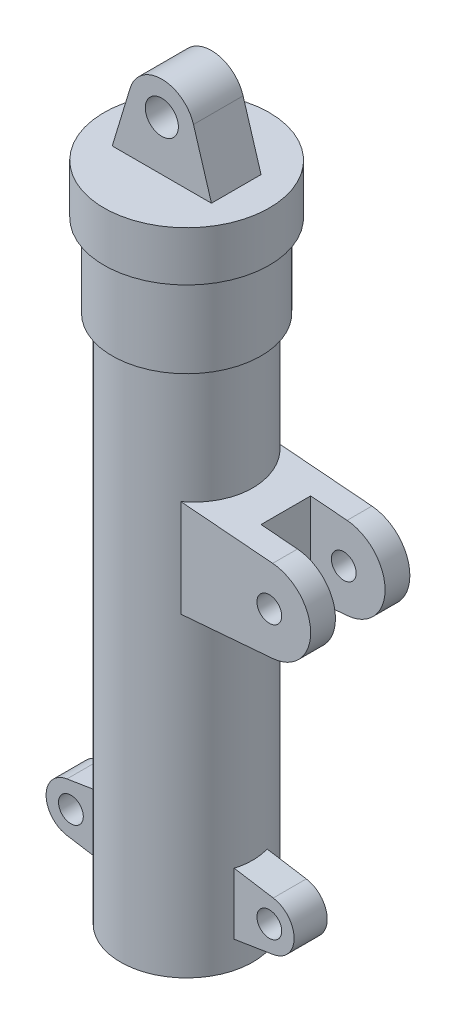
ISO-10303-21;
HEADER;
FILE_DESCRIPTION(('STEP AP214'),'2;1');
FILE_NAME('part.step','',(''),(''),'','','');
FILE_SCHEMA(('AUTOMOTIVE_DESIGN { 1 0 10303 214 1 1 1 1 }'));
ENDSEC;
DATA;
#1=APPLICATION_CONTEXT('core data for automotive mechanical design processes');
#2=APPLICATION_PROTOCOL_DEFINITION('international standard','automotive_design',2000,#1);
#3=PRODUCT_CONTEXT('',#1,'mechanical');
#4=PRODUCT('Part','Part','',(#3));
#5=PRODUCT_RELATED_PRODUCT_CATEGORY('part','',(#4));
#6=PRODUCT_DEFINITION_FORMATION('','',#4);
#7=PRODUCT_DEFINITION_CONTEXT('part definition',#1,'design');
#8=PRODUCT_DEFINITION('design','',#6,#7);
#9=PRODUCT_DEFINITION_SHAPE('','',#8);
#10=(LENGTH_UNIT() NAMED_UNIT(*) SI_UNIT(.MILLI.,.METRE.));
#11=(NAMED_UNIT(*) PLANE_ANGLE_UNIT() SI_UNIT($,.RADIAN.));
#12=(NAMED_UNIT(*) SI_UNIT($,.STERADIAN.) SOLID_ANGLE_UNIT());
#13=UNCERTAINTY_MEASURE_WITH_UNIT(LENGTH_MEASURE(1.E-05),#10,'distance_accuracy_value','');
#14=(GEOMETRIC_REPRESENTATION_CONTEXT(3) GLOBAL_UNCERTAINTY_ASSIGNED_CONTEXT((#13)) GLOBAL_UNIT_ASSIGNED_CONTEXT((#10,
#11,#12)) REPRESENTATION_CONTEXT('',''));
#15=CARTESIAN_POINT('',(0.,0.,0.));
#16=DIRECTION('',(0.,0.,1.));
#17=DIRECTION('',(1.,0.,0.));
#18=AXIS2_PLACEMENT_3D('',#15,#16,#17);
#19=CARTESIAN_POINT('',(20.,250.,30.));
#20=DIRECTION('',(-0.0816633199329582,-0.996659973199249,0.));
#21=DIRECTION('',(0.996659973199249,-0.0816633199329582,0.));
#22=AXIS2_PLACEMENT_3D('',#19,#20,#21);
#23=PLANE('',#22);
#24=DIRECTION('',(-0.996659973199249,0.0816633199329582,0.));
#25=VECTOR('',#24,1.);
#26=CARTESIAN_POINT('',(20.,250.,-15.));
#27=LINE('',#26,#25);
#28=CARTESIAN_POINT('',(82.0415829983239,244.916499329981,-15.));
#29=VERTEX_POINT('',#28);
#30=CARTESIAN_POINT('',(60.,246.722520332754,-15.));
#31=VERTEX_POINT('',#30);
#32=EDGE_CURVE('E185',#29,#31,#27,.T.);
#33=ORIENTED_EDGE('',*,*,#32,.F.);
#34=DIRECTION('',(0.,0.,-1.));
#35=VECTOR('',#34,1.);
#36=CARTESIAN_POINT('',(82.0415829983239,244.916499329981,30.));
#37=LINE('',#36,#35);
#38=CARTESIAN_POINT('',(82.0415829983239,244.916499329981,-30.));
#39=VERTEX_POINT('',#38);
#40=EDGE_CURVE('E220',#29,#39,#37,.T.);
#41=ORIENTED_EDGE('',*,*,#40,.T.);
#42=DIRECTION('',(-0.996659973199249,0.0816633199329583,0.));
#43=VECTOR('',#42,1.);
#44=CARTESIAN_POINT('',(20.,250.,-30.));
#45=LINE('',#44,#43);
#46=CARTESIAN_POINT('',(26.4575131106459,249.470890801972,-30.));
#47=VERTEX_POINT('',#46);
#48=EDGE_CURVE('E210',#39,#47,#45,.T.);
#49=ORIENTED_EDGE('',*,*,#48,.T.);
#50=CARTESIAN_POINT('',(0.,251.638739833623,0.));
#51=DIRECTION('',(-0.0816633199329582,-0.996659973199249,0.));
#52=DIRECTION('',(0.996659973199249,-0.0816633199329582,0.));
#53=AXIS2_PLACEMENT_3D('',#50,#51,#52);
#54=ELLIPSE('',#53,40.13404879861,40.);
#55=CARTESIAN_POINT('',(26.4575131106459,249.470890801972,30.));
#56=VERTEX_POINT('',#55);
#57=EDGE_CURVE('E236',#56,#47,#54,.F.);
#58=ORIENTED_EDGE('',*,*,#57,.F.);
#59=DIRECTION('',(-0.996659973199249,0.0816633199329583,0.));
#60=VECTOR('',#59,1.);
#61=CARTESIAN_POINT('',(20.,250.,30.));
#62=LINE('',#61,#60);
#63=CARTESIAN_POINT('',(82.0415829983239,244.916499329981,30.));
#64=VERTEX_POINT('',#63);
#65=EDGE_CURVE('E213',#64,#56,#62,.T.);
#66=ORIENTED_EDGE('',*,*,#65,.F.);
#67=CARTESIAN_POINT('',(82.0415829983239,244.916499329981,15.));
#68=VERTEX_POINT('',#67);
#69=EDGE_CURVE('E194',#64,#68,#37,.T.);
#70=ORIENTED_EDGE('',*,*,#69,.T.);
#71=DIRECTION('',(-0.996659973199249,0.0816633199329582,0.));
#72=VECTOR('',#71,1.);
#73=CARTESIAN_POINT('',(20.,250.,15.));
#74=LINE('',#73,#72);
#75=CARTESIAN_POINT('',(60.,246.722520332754,15.));
#76=VERTEX_POINT('',#75);
#77=EDGE_CURVE('E53',#68,#76,#74,.T.);
#78=ORIENTED_EDGE('',*,*,#77,.T.);
#79=DIRECTION('',(0.,0.,-1.));
#80=VECTOR('',#79,1.);
#81=CARTESIAN_POINT('',(60.,246.722520332754,30.));
#82=LINE('',#81,#80);
#83=EDGE_CURVE('E177',#76,#31,#82,.T.);
#84=ORIENTED_EDGE('',*,*,#83,.T.);
#85=EDGE_LOOP('',(#33,#41,#49,#58,#66,#70,#78,#84));
#86=FACE_BOUND('',#85,.T.);
#87=ADVANCED_FACE('F38',(#86),#23,.F.);
#88=CARTESIAN_POINT('',(20.,190.,30.));
#89=DIRECTION('',(-0.0816633199329573,0.996659973199249,0.));
#90=DIRECTION('',(-0.996659973199249,-0.0816633199329573,0.));
#91=AXIS2_PLACEMENT_3D('',#88,#89,#90);
#92=PLANE('',#91);
#93=DIRECTION('',(0.996659973199249,0.0816633199329573,0.));
#94=VECTOR('',#93,1.);
#95=CARTESIAN_POINT('',(20.,190.,-15.));
#96=LINE('',#95,#94);
#97=CARTESIAN_POINT('',(60.,193.277479667246,-15.));
#98=VERTEX_POINT('',#97);
#99=CARTESIAN_POINT('',(82.041582998324,195.083500670019,-15.));
#100=VERTEX_POINT('',#99);
#101=EDGE_CURVE('E204',#98,#100,#96,.T.);
#102=ORIENTED_EDGE('',*,*,#101,.F.);
#103=DIRECTION('',(0.,0.,1.));
#104=VECTOR('',#103,1.);
#105=CARTESIAN_POINT('',(60.,193.277479667246,30.));
#106=LINE('',#105,#104);
#107=CARTESIAN_POINT('',(60.,193.277479667246,15.));
#108=VERTEX_POINT('',#107);
#109=EDGE_CURVE('E11',#98,#108,#106,.T.);
#110=ORIENTED_EDGE('',*,*,#109,.T.);
#111=DIRECTION('',(0.996659973199249,0.0816633199329573,0.));
#112=VECTOR('',#111,1.);
#113=CARTESIAN_POINT('',(20.,190.,15.));
#114=LINE('',#113,#112);
#115=CARTESIAN_POINT('',(82.041582998324,195.083500670019,15.));
#116=VERTEX_POINT('',#115);
#117=EDGE_CURVE('E189',#108,#116,#114,.T.);
#118=ORIENTED_EDGE('',*,*,#117,.T.);
#119=DIRECTION('',(0.,0.,-1.));
#120=VECTOR('',#119,1.);
#121=CARTESIAN_POINT('',(82.041582998324,195.083500670019,30.));
#122=LINE('',#121,#120);
#123=CARTESIAN_POINT('',(82.041582998324,195.083500670019,30.));
#124=VERTEX_POINT('',#123);
#125=EDGE_CURVE('E230',#124,#116,#122,.T.);
#126=ORIENTED_EDGE('',*,*,#125,.F.);
#127=DIRECTION('',(0.996659973199249,0.0816633199329573,0.));
#128=VECTOR('',#127,1.);
#129=CARTESIAN_POINT('',(20.,190.,30.));
#130=LINE('',#129,#128);
#131=CARTESIAN_POINT('',(26.457513110646,190.529109198028,30.));
#132=VERTEX_POINT('',#131);
#133=EDGE_CURVE('E61',#132,#124,#130,.T.);
#134=ORIENTED_EDGE('',*,*,#133,.F.);
#135=CARTESIAN_POINT('',(0.,188.361260166377,0.));
#136=DIRECTION('',(-0.0816633199329573,0.996659973199249,0.));
#137=DIRECTION('',(-0.996659973199249,-0.0816633199329573,0.));
#138=AXIS2_PLACEMENT_3D('',#135,#136,#137);
#139=ELLIPSE('',#138,40.13404879861,40.);
#140=CARTESIAN_POINT('',(26.457513110646,190.529109198028,-30.));
#141=VERTEX_POINT('',#140);
#142=EDGE_CURVE('E233',#141,#132,#139,.F.);
#143=ORIENTED_EDGE('',*,*,#142,.F.);
#144=DIRECTION('',(0.996659973199249,0.0816633199329573,0.));
#145=VECTOR('',#144,1.);
#146=CARTESIAN_POINT('',(20.,190.,-30.));
#147=LINE('',#146,#145);
#148=CARTESIAN_POINT('',(82.041582998324,195.083500670019,-30.));
#149=VERTEX_POINT('',#148);
#150=EDGE_CURVE('E223',#141,#149,#147,.T.);
#151=ORIENTED_EDGE('',*,*,#150,.T.);
#152=EDGE_CURVE('E229',#100,#149,#122,.T.);
#153=ORIENTED_EDGE('',*,*,#152,.F.);
#154=EDGE_LOOP('',(#102,#110,#118,#126,#134,#143,#151,#153));
#155=FACE_BOUND('',#154,.T.);
#156=ADVANCED_FACE('F389',(#155),#92,.F.);
#157=CARTESIAN_POINT('',(80.,220.,30.));
#158=DIRECTION('',(0.,0.,-1.));
#159=DIRECTION('',(-1.,0.,0.));
#160=AXIS2_PLACEMENT_3D('',#157,#158,#159);
#161=CYLINDRICAL_SURFACE('',#160,25.);
#162=CARTESIAN_POINT('',(80.,220.,-15.));
#163=DIRECTION('',(0.,0.,1.));
#164=DIRECTION('',(1.,0.,0.));
#165=AXIS2_PLACEMENT_3D('',#162,#163,#164);
#166=CIRCLE('',#165,25.);
#167=EDGE_CURVE('E198',#100,#29,#166,.T.);
#168=ORIENTED_EDGE('',*,*,#167,.F.);
#169=ORIENTED_EDGE('',*,*,#152,.T.);
#170=CARTESIAN_POINT('',(80.,220.,-30.));
#171=DIRECTION('',(0.,0.,1.));
#172=DIRECTION('',(1.,0.,0.));
#173=AXIS2_PLACEMENT_3D('',#170,#171,#172);
#174=CIRCLE('',#173,25.);
#175=EDGE_CURVE('E216',#149,#39,#174,.T.);
#176=ORIENTED_EDGE('',*,*,#175,.T.);
#177=ORIENTED_EDGE('',*,*,#40,.F.);
#178=EDGE_LOOP('',(#168,#169,#176,#177));
#179=FACE_BOUND('',#178,.T.);
#180=ADVANCED_FACE('F393',(#179),#161,.T.);
#181=CARTESIAN_POINT('',(80.,220.,30.));
#182=DIRECTION('',(0.,0.,-1.));
#183=DIRECTION('',(-1.,0.,0.));
#184=AXIS2_PLACEMENT_3D('',#181,#182,#183);
#185=CYLINDRICAL_SURFACE('',#184,7.50000000000001);
#186=CARTESIAN_POINT('',(80.,220.,-30.));
#187=DIRECTION('',(0.,0.,1.));
#188=DIRECTION('',(1.,0.,0.));
#189=AXIS2_PLACEMENT_3D('',#186,#187,#188);
#190=CIRCLE('',#189,7.50000000000001);
#191=CARTESIAN_POINT('',(87.5,220.,-30.));
#192=VERTEX_POINT('',#191);
#193=EDGE_CURVE('E184',#192,#192,#190,.T.);
#194=ORIENTED_EDGE('',*,*,#193,.F.);
#195=EDGE_LOOP('',(#194));
#196=FACE_BOUND('',#195,.T.);
#197=CARTESIAN_POINT('',(80.,220.,-15.));
#198=DIRECTION('',(0.,0.,1.));
#199=DIRECTION('',(1.,0.,0.));
#200=AXIS2_PLACEMENT_3D('',#197,#198,#199);
#201=CIRCLE('',#200,7.50000000000001);
#202=CARTESIAN_POINT('',(87.5,220.,-15.));
#203=VERTEX_POINT('',#202);
#204=EDGE_CURVE('E195',#203,#203,#201,.T.);
#205=ORIENTED_EDGE('',*,*,#204,.T.);
#206=EDGE_LOOP('',(#205));
#207=FACE_BOUND('',#206,.T.);
#208=ADVANCED_FACE('F416',(#196,#207),#185,.F.);
#209=CARTESIAN_POINT('',(0.,-64.3364928909953,0.));
#210=DIRECTION('',(0.,-1.,0.));
#211=DIRECTION('',(0.,0.,-1.));
#212=AXIS2_PLACEMENT_3D('',#209,#210,#211);
#213=CYLINDRICAL_SURFACE('',#212,40.);
#214=DIRECTION('',(0.,-1.,0.));
#215=VECTOR('',#214,1.);
#216=CARTESIAN_POINT('',(-38.7298334620742,-64.3364928909953,10.));
#217=LINE('',#216,#215);
#218=CARTESIAN_POINT('',(-38.7298334620742,16.3992579379608,10.));
#219=VERTEX_POINT('',#218);
#220=CARTESIAN_POINT('',(-38.7298334620742,53.6007420620392,10.));
#221=VERTEX_POINT('',#220);
#222=EDGE_CURVE('E268',#219,#221,#217,.F.);
#223=ORIENTED_EDGE('',*,*,#222,.F.);
#224=CARTESIAN_POINT('',(0.,10.1914617476733,0.));
#225=DIRECTION('',(-0.158264501869385,-0.987396752804077,0.));
#226=DIRECTION('',(0.987396752804077,-0.158264501869385,0.));
#227=AXIS2_PLACEMENT_3D('',#224,#225,#226);
#228=ELLIPSE('',#227,40.5105646604623,40.);
#229=CARTESIAN_POINT('',(-38.7298334620742,16.3992579379608,-10.));
#230=VERTEX_POINT('',#229);
#231=EDGE_CURVE('E273',#230,#219,#228,.F.);
#232=ORIENTED_EDGE('',*,*,#231,.F.);
#233=DIRECTION('',(0.,-1.,0.));
#234=VECTOR('',#233,1.);
#235=CARTESIAN_POINT('',(-38.7298334620742,-64.3364928909953,-10.));
#236=LINE('',#235,#234);
#237=CARTESIAN_POINT('',(-38.7298334620742,53.6007420620392,-10.));
#238=VERTEX_POINT('',#237);
#239=EDGE_CURVE('E265',#230,#238,#236,.F.);
#240=ORIENTED_EDGE('',*,*,#239,.T.);
#241=CARTESIAN_POINT('',(0.,59.8085382523267,0.));
#242=DIRECTION('',(-0.158264501869385,0.987396752804077,0.));
#243=DIRECTION('',(-0.987396752804077,-0.158264501869385,0.));
#244=AXIS2_PLACEMENT_3D('',#241,#242,#243);
#245=ELLIPSE('',#244,40.5105646604623,40.);
#246=EDGE_CURVE('E270',#221,#238,#245,.F.);
#247=ORIENTED_EDGE('',*,*,#246,.F.);
#248=EDGE_LOOP('',(#223,#232,#240,#247));
#249=FACE_BOUND('',#248,.T.);
#250=CARTESIAN_POINT('',(0.,320.,0.));
#251=DIRECTION('',(0.,-1.,0.));
#252=DIRECTION('',(0.,0.,-1.));
#253=AXIS2_PLACEMENT_3D('',#250,#251,#252);
#254=CIRCLE('',#253,40.);
#255=CARTESIAN_POINT('',(0.,320.,-40.));
#256=VERTEX_POINT('',#255);
#257=EDGE_CURVE('E360',#256,#256,#254,.T.);
#258=ORIENTED_EDGE('',*,*,#257,.T.);
#259=EDGE_LOOP('',(#258));
#260=FACE_BOUND('',#259,.T.);
#261=CARTESIAN_POINT('',(0.,0.,0.));
#262=DIRECTION('',(0.,-1.,0.));
#263=DIRECTION('',(0.,0.,-1.));
#264=AXIS2_PLACEMENT_3D('',#261,#262,#263);
#265=CIRCLE('',#264,40.);
#266=CARTESIAN_POINT('',(0.,0.,-40.));
#267=VERTEX_POINT('',#266);
#268=EDGE_CURVE('E357',#267,#267,#265,.T.);
#269=ORIENTED_EDGE('',*,*,#268,.F.);
#270=EDGE_LOOP('',(#269));
#271=FACE_BOUND('',#270,.T.);
#272=DIRECTION('',(0.,-1.,0.));
#273=VECTOR('',#272,1.);
#274=CARTESIAN_POINT('',(38.7298334620742,-64.3364928909953,-10.));
#275=LINE('',#274,#273);
#276=CARTESIAN_POINT('',(38.7298334620742,53.6007420620392,-10.));
#277=VERTEX_POINT('',#276);
#278=CARTESIAN_POINT('',(38.7298334620742,16.3992579379608,-10.));
#279=VERTEX_POINT('',#278);
#280=EDGE_CURVE('E306',#277,#279,#275,.T.);
#281=ORIENTED_EDGE('',*,*,#280,.T.);
#282=CARTESIAN_POINT('',(0.,10.1914617476733,0.));
#283=DIRECTION('',(-0.158264501869385,0.987396752804077,0.));
#284=DIRECTION('',(-0.987396752804077,-0.158264501869385,0.));
#285=AXIS2_PLACEMENT_3D('',#282,#283,#284);
#286=ELLIPSE('',#285,40.5105646604623,40.);
#287=CARTESIAN_POINT('',(38.7298334620742,16.3992579379608,10.));
#288=VERTEX_POINT('',#287);
#289=EDGE_CURVE('E303',#279,#288,#286,.F.);
#290=ORIENTED_EDGE('',*,*,#289,.T.);
#291=DIRECTION('',(0.,-1.,0.));
#292=VECTOR('',#291,1.);
#293=CARTESIAN_POINT('',(38.7298334620742,-64.3364928909953,10.));
#294=LINE('',#293,#292);
#295=CARTESIAN_POINT('',(38.7298334620742,53.6007420620392,10.));
#296=VERTEX_POINT('',#295);
#297=EDGE_CURVE('E309',#296,#288,#294,.T.);
#298=ORIENTED_EDGE('',*,*,#297,.F.);
#299=CARTESIAN_POINT('',(0.,59.8085382523267,0.));
#300=DIRECTION('',(-0.158264501869385,-0.987396752804077,0.));
#301=DIRECTION('',(0.987396752804077,-0.158264501869385,0.));
#302=AXIS2_PLACEMENT_3D('',#299,#300,#301);
#303=ELLIPSE('',#302,40.5105646604623,40.);
#304=EDGE_CURVE('E300',#296,#277,#303,.F.);
#305=ORIENTED_EDGE('',*,*,#304,.T.);
#306=EDGE_LOOP('',(#281,#290,#298,#305));
#307=FACE_BOUND('',#306,.T.);
#308=DIRECTION('',(0.,-1.,0.));
#309=VECTOR('',#308,1.);
#310=CARTESIAN_POINT('',(26.4575131106459,-64.3364928909953,30.));
#311=LINE('',#310,#309);
#312=EDGE_CURVE('E46',#56,#132,#311,.T.);
#313=ORIENTED_EDGE('',*,*,#312,.F.);
#314=ORIENTED_EDGE('',*,*,#57,.T.);
#315=DIRECTION('',(0.,-1.,0.));
#316=VECTOR('',#315,1.);
#317=CARTESIAN_POINT('',(26.4575131106459,-64.3364928909953,-30.));
#318=LINE('',#317,#316);
#319=EDGE_CURVE('E375',#47,#141,#318,.T.);
#320=ORIENTED_EDGE('',*,*,#319,.T.);
#321=ORIENTED_EDGE('',*,*,#142,.T.);
#322=EDGE_LOOP('',(#313,#314,#320,#321));
#323=FACE_BOUND('',#322,.T.);
#324=ADVANCED_FACE('F399',(#249,#260,#271,#307,#323),#213,.T.);
#325=CARTESIAN_POINT('',(0.,-64.3364928909953,0.));
#326=DIRECTION('',(0.,-1.,0.));
#327=DIRECTION('',(0.,0.,-1.));
#328=AXIS2_PLACEMENT_3D('',#325,#326,#327);
#329=CYLINDRICAL_SURFACE('',#328,35.);
#330=CARTESIAN_POINT('',(0.,4.99999999999999,0.));
#331=DIRECTION('',(0.,-1.,0.));
#332=DIRECTION('',(0.,0.,-1.));
#333=AXIS2_PLACEMENT_3D('',#330,#331,#332);
#334=CIRCLE('',#333,35.);
#335=CARTESIAN_POINT('',(0.,4.99999999999999,-35.));
#336=VERTEX_POINT('',#335);
#337=EDGE_CURVE('E348',#336,#336,#334,.T.);
#338=ORIENTED_EDGE('',*,*,#337,.T.);
#339=EDGE_LOOP('',(#338));
#340=FACE_BOUND('',#339,.T.);
#341=CARTESIAN_POINT('',(0.,385.,0.));
#342=DIRECTION('',(0.,-1.,0.));
#343=DIRECTION('',(0.,0.,-1.));
#344=AXIS2_PLACEMENT_3D('',#341,#342,#343);
#345=CIRCLE('',#344,35.);
#346=CARTESIAN_POINT('',(0.,385.,-35.));
#347=VERTEX_POINT('',#346);
#348=EDGE_CURVE('E345',#347,#347,#345,.T.);
#349=ORIENTED_EDGE('',*,*,#348,.F.);
#350=EDGE_LOOP('',(#349));
#351=FACE_BOUND('',#350,.T.);
#352=ADVANCED_FACE('F503',(#340,#351),#329,.F.);
#353=CARTESIAN_POINT('',(0.,400.,0.));
#354=DIRECTION('',(0.,1.,0.));
#355=DIRECTION('',(0.,0.,1.));
#356=AXIS2_PLACEMENT_3D('',#353,#354,#355);
#357=PLANE('',#356);
#358=CARTESIAN_POINT('',(0.,400.,0.));
#359=DIRECTION('',(0.,-1.,0.));
#360=DIRECTION('',(0.,0.,-1.));
#361=AXIS2_PLACEMENT_3D('',#358,#359,#360);
#362=CIRCLE('',#361,50.);
#363=CARTESIAN_POINT('',(0.,400.,-50.));
#364=VERTEX_POINT('',#363);
#365=EDGE_CURVE('E372',#364,#364,#362,.T.);
#366=ORIENTED_EDGE('',*,*,#365,.F.);
#367=EDGE_LOOP('',(#366));
#368=FACE_BOUND('',#367,.T.);
#369=DIRECTION('',(0.,0.,-1.));
#370=VECTOR('',#369,1.);
#371=CARTESIAN_POINT('',(-30.,400.,15.));
#372=LINE('',#371,#370);
#373=CARTESIAN_POINT('',(-30.,400.,15.));
#374=VERTEX_POINT('',#373);
#375=CARTESIAN_POINT('',(-30.,400.,-15.));
#376=VERTEX_POINT('',#375);
#377=EDGE_CURVE('E342',#374,#376,#372,.T.);
#378=ORIENTED_EDGE('',*,*,#377,.T.);
#379=DIRECTION('',(1.,0.,0.));
#380=VECTOR('',#379,1.);
#381=CARTESIAN_POINT('',(-30.,400.,-15.));
#382=LINE('',#381,#380);
#383=CARTESIAN_POINT('',(30.,400.,-15.));
#384=VERTEX_POINT('',#383);
#385=EDGE_CURVE('E329',#376,#384,#382,.T.);
#386=ORIENTED_EDGE('',*,*,#385,.T.);
#387=DIRECTION('',(0.,0.,-1.));
#388=VECTOR('',#387,1.);
#389=CARTESIAN_POINT('',(30.,400.,15.));
#390=LINE('',#389,#388);
#391=CARTESIAN_POINT('',(30.,400.,15.));
#392=VERTEX_POINT('',#391);
#393=EDGE_CURVE('E340',#392,#384,#390,.T.);
#394=ORIENTED_EDGE('',*,*,#393,.F.);
#395=DIRECTION('',(1.,0.,0.));
#396=VECTOR('',#395,1.);
#397=CARTESIAN_POINT('',(-30.,400.,15.));
#398=LINE('',#397,#396);
#399=EDGE_CURVE('E320',#374,#392,#398,.T.);
#400=ORIENTED_EDGE('',*,*,#399,.F.);
#401=EDGE_LOOP('',(#378,#386,#394,#400));
#402=FACE_BOUND('',#401,.T.);
#403=ADVANCED_FACE('F40',(#368,#402),#357,.T.);
#404=CARTESIAN_POINT('',(0.,-64.3364928909953,0.));
#405=DIRECTION('',(0.,-1.,0.));
#406=DIRECTION('',(0.,0.,-1.));
#407=AXIS2_PLACEMENT_3D('',#404,#405,#406);
#408=CYLINDRICAL_SURFACE('',#407,50.);
#409=ORIENTED_EDGE('',*,*,#365,.T.);
#410=EDGE_LOOP('',(#409));
#411=FACE_BOUND('',#410,.T.);
#412=CARTESIAN_POINT('',(0.,370.,0.));
#413=DIRECTION('',(0.,-1.,0.));
#414=DIRECTION('',(0.,0.,-1.));
#415=AXIS2_PLACEMENT_3D('',#412,#413,#414);
#416=CIRCLE('',#415,50.);
#417=CARTESIAN_POINT('',(0.,370.,-50.));
#418=VERTEX_POINT('',#417);
#419=EDGE_CURVE('E369',#418,#418,#416,.T.);
#420=ORIENTED_EDGE('',*,*,#419,.F.);
#421=EDGE_LOOP('',(#420));
#422=FACE_BOUND('',#421,.T.);
#423=ADVANCED_FACE('F531',(#411,#422),#408,.T.);
#424=CARTESIAN_POINT('',(50.,370.,0.));
#425=DIRECTION('',(0.,-1.,0.));
#426=DIRECTION('',(0.,0.,-1.));
#427=AXIS2_PLACEMENT_3D('',#424,#425,#426);
#428=PLANE('',#427);
#429=ORIENTED_EDGE('',*,*,#419,.T.);
#430=EDGE_LOOP('',(#429));
#431=FACE_BOUND('',#430,.T.);
#432=CARTESIAN_POINT('',(0.,370.,0.));
#433=DIRECTION('',(0.,-1.,0.));
#434=DIRECTION('',(0.,0.,-1.));
#435=AXIS2_PLACEMENT_3D('',#432,#433,#434);
#436=CIRCLE('',#435,45.);
#437=CARTESIAN_POINT('',(0.,370.,-45.));
#438=VERTEX_POINT('',#437);
#439=EDGE_CURVE('E366',#438,#438,#436,.T.);
#440=ORIENTED_EDGE('',*,*,#439,.F.);
#441=EDGE_LOOP('',(#440));
#442=FACE_BOUND('',#441,.T.);
#443=ADVANCED_FACE('F528',(#431,#442),#428,.T.);
#444=CARTESIAN_POINT('',(0.,-64.3364928909953,0.));
#445=DIRECTION('',(0.,-1.,0.));
#446=DIRECTION('',(0.,0.,-1.));
#447=AXIS2_PLACEMENT_3D('',#444,#445,#446);
#448=CYLINDRICAL_SURFACE('',#447,45.);
#449=ORIENTED_EDGE('',*,*,#439,.T.);
#450=EDGE_LOOP('',(#449));
#451=FACE_BOUND('',#450,.T.);
#452=CARTESIAN_POINT('',(0.,320.,0.));
#453=DIRECTION('',(0.,-1.,0.));
#454=DIRECTION('',(0.,0.,-1.));
#455=AXIS2_PLACEMENT_3D('',#452,#453,#454);
#456=CIRCLE('',#455,45.);
#457=CARTESIAN_POINT('',(0.,320.,-45.));
#458=VERTEX_POINT('',#457);
#459=EDGE_CURVE('E363',#458,#458,#456,.T.);
#460=ORIENTED_EDGE('',*,*,#459,.F.);
#461=EDGE_LOOP('',(#460));
#462=FACE_BOUND('',#461,.T.);
#463=ADVANCED_FACE('F524',(#451,#462),#448,.T.);
#464=CARTESIAN_POINT('',(45.,320.,0.));
#465=DIRECTION('',(0.,-1.,0.));
#466=DIRECTION('',(0.,0.,-1.));
#467=AXIS2_PLACEMENT_3D('',#464,#465,#466);
#468=PLANE('',#467);
#469=ORIENTED_EDGE('',*,*,#459,.T.);
#470=EDGE_LOOP('',(#469));
#471=FACE_BOUND('',#470,.T.);
#472=ORIENTED_EDGE('',*,*,#257,.F.);
#473=EDGE_LOOP('',(#472));
#474=FACE_BOUND('',#473,.T.);
#475=ADVANCED_FACE('F517',(#471,#474),#468,.T.);
#476=CARTESIAN_POINT('',(40.,0.,0.));
#477=DIRECTION('',(0.,-1.,0.));
#478=DIRECTION('',(0.,0.,-1.));
#479=AXIS2_PLACEMENT_3D('',#476,#477,#478);
#480=PLANE('',#479);
#481=ORIENTED_EDGE('',*,*,#268,.T.);
#482=EDGE_LOOP('',(#481));
#483=FACE_BOUND('',#482,.T.);
#484=CARTESIAN_POINT('',(0.,0.,0.));
#485=DIRECTION('',(0.,-1.,0.));
#486=DIRECTION('',(0.,0.,-1.));
#487=AXIS2_PLACEMENT_3D('',#484,#485,#486);
#488=CIRCLE('',#487,22.5);
#489=CARTESIAN_POINT('',(0.,0.,-22.5));
#490=VERTEX_POINT('',#489);
#491=EDGE_CURVE('E354',#490,#490,#488,.T.);
#492=ORIENTED_EDGE('',*,*,#491,.F.);
#493=EDGE_LOOP('',(#492));
#494=FACE_BOUND('',#493,.T.);
#495=ADVANCED_FACE('F513',(#483,#494),#480,.T.);
#496=CARTESIAN_POINT('',(0.,-64.3364928909953,0.));
#497=DIRECTION('',(0.,-1.,0.));
#498=DIRECTION('',(0.,0.,-1.));
#499=AXIS2_PLACEMENT_3D('',#496,#497,#498);
#500=CYLINDRICAL_SURFACE('',#499,22.5);
#501=ORIENTED_EDGE('',*,*,#491,.T.);
#502=EDGE_LOOP('',(#501));
#503=FACE_BOUND('',#502,.T.);
#504=CARTESIAN_POINT('',(0.,5.,0.));
#505=DIRECTION('',(0.,-1.,0.));
#506=DIRECTION('',(0.,0.,-1.));
#507=AXIS2_PLACEMENT_3D('',#504,#505,#506);
#508=CIRCLE('',#507,22.5);
#509=CARTESIAN_POINT('',(0.,5.,-22.5));
#510=VERTEX_POINT('',#509);
#511=EDGE_CURVE('E351',#510,#510,#508,.T.);
#512=ORIENTED_EDGE('',*,*,#511,.F.);
#513=EDGE_LOOP('',(#512));
#514=FACE_BOUND('',#513,.T.);
#515=ADVANCED_FACE('F509',(#503,#514),#500,.F.);
#516=CARTESIAN_POINT('',(22.5,5.,0.));
#517=DIRECTION('',(0.,1.,0.));
#518=DIRECTION('',(0.,0.,1.));
#519=AXIS2_PLACEMENT_3D('',#516,#517,#518);
#520=PLANE('',#519);
#521=ORIENTED_EDGE('',*,*,#511,.T.);
#522=EDGE_LOOP('',(#521));
#523=FACE_BOUND('',#522,.T.);
#524=ORIENTED_EDGE('',*,*,#337,.F.);
#525=EDGE_LOOP('',(#524));
#526=FACE_BOUND('',#525,.T.);
#527=ADVANCED_FACE('F501',(#523,#526),#520,.T.);
#528=CARTESIAN_POINT('',(35.,385.,0.));
#529=DIRECTION('',(0.,-1.,0.));
#530=DIRECTION('',(0.,0.,-1.));
#531=AXIS2_PLACEMENT_3D('',#528,#529,#530);
#532=PLANE('',#531);
#533=ORIENTED_EDGE('',*,*,#348,.T.);
#534=EDGE_LOOP('',(#533));
#535=FACE_BOUND('',#534,.T.);
#536=ADVANCED_FACE('F483',(#535),#532,.T.);
#537=CARTESIAN_POINT('',(0.,430.,15.));
#538=DIRECTION('',(0.,0.,1.));
#539=DIRECTION('',(1.,0.,0.));
#540=AXIS2_PLACEMENT_3D('',#537,#538,#539);
#541=PLANE('',#540);
#542=DIRECTION('',(-0.29027623112899,-0.956942897795657,0.));
#543=VECTOR('',#542,1.);
#544=CARTESIAN_POINT('',(-30.,400.,15.));
#545=LINE('',#544,#543);
#546=CARTESIAN_POINT('',(-19.1388579559131,435.80552462258,15.));
#547=VERTEX_POINT('',#546);
#548=EDGE_CURVE('E318',#547,#374,#545,.T.);
#549=ORIENTED_EDGE('',*,*,#548,.T.);
#550=ORIENTED_EDGE('',*,*,#399,.T.);
#551=DIRECTION('',(-0.29027623112899,0.956942897795657,0.));
#552=VECTOR('',#551,1.);
#553=CARTESIAN_POINT('',(30.,400.,15.));
#554=LINE('',#553,#552);
#555=CARTESIAN_POINT('',(19.1388579559131,435.80552462258,15.));
#556=VERTEX_POINT('',#555);
#557=EDGE_CURVE('E323',#392,#556,#554,.T.);
#558=ORIENTED_EDGE('',*,*,#557,.T.);
#559=CARTESIAN_POINT('',(0.,430.,15.));
#560=DIRECTION('',(0.,0.,1.));
#561=DIRECTION('',(1.,0.,0.));
#562=AXIS2_PLACEMENT_3D('',#559,#560,#561);
#563=CIRCLE('',#562,20.);
#564=EDGE_CURVE('E325',#556,#547,#563,.T.);
#565=ORIENTED_EDGE('',*,*,#564,.T.);
#566=EDGE_LOOP('',(#549,#550,#558,#565));
#567=FACE_BOUND('',#566,.T.);
#568=CARTESIAN_POINT('',(0.,430.,15.));
#569=DIRECTION('',(0.,0.,1.));
#570=DIRECTION('',(1.,0.,0.));
#571=AXIS2_PLACEMENT_3D('',#568,#569,#570);
#572=CIRCLE('',#571,10.);
#573=CARTESIAN_POINT('',(10.,430.,15.));
#574=VERTEX_POINT('',#573);
#575=EDGE_CURVE('E312',#574,#574,#572,.T.);
#576=ORIENTED_EDGE('',*,*,#575,.F.);
#577=EDGE_LOOP('',(#576));
#578=FACE_BOUND('',#577,.T.);
#579=ADVANCED_FACE('F479',(#567,#578),#541,.T.);
#580=CARTESIAN_POINT('',(0.,430.,-15.));
#581=DIRECTION('',(0.,0.,1.));
#582=DIRECTION('',(1.,0.,0.));
#583=AXIS2_PLACEMENT_3D('',#580,#581,#582);
#584=PLANE('',#583);
#585=DIRECTION('',(-0.29027623112899,-0.956942897795657,0.));
#586=VECTOR('',#585,1.);
#587=CARTESIAN_POINT('',(-30.,400.,-15.));
#588=LINE('',#587,#586);
#589=CARTESIAN_POINT('',(-19.1388579559131,435.80552462258,-15.));
#590=VERTEX_POINT('',#589);
#591=EDGE_CURVE('E315',#590,#376,#588,.T.);
#592=ORIENTED_EDGE('',*,*,#591,.F.);
#593=CARTESIAN_POINT('',(0.,430.,-15.));
#594=DIRECTION('',(0.,0.,1.));
#595=DIRECTION('',(1.,0.,0.));
#596=AXIS2_PLACEMENT_3D('',#593,#594,#595);
#597=CIRCLE('',#596,20.);
#598=CARTESIAN_POINT('',(19.1388579559131,435.80552462258,-15.));
#599=VERTEX_POINT('',#598);
#600=EDGE_CURVE('E321',#599,#590,#597,.T.);
#601=ORIENTED_EDGE('',*,*,#600,.F.);
#602=DIRECTION('',(-0.29027623112899,0.956942897795657,0.));
#603=VECTOR('',#602,1.);
#604=CARTESIAN_POINT('',(30.,400.,-15.));
#605=LINE('',#604,#603);
#606=EDGE_CURVE('E332',#384,#599,#605,.T.);
#607=ORIENTED_EDGE('',*,*,#606,.F.);
#608=ORIENTED_EDGE('',*,*,#385,.F.);
#609=EDGE_LOOP('',(#592,#601,#607,#608));
#610=FACE_BOUND('',#609,.T.);
#611=CARTESIAN_POINT('',(0.,430.,-15.));
#612=DIRECTION('',(0.,0.,1.));
#613=DIRECTION('',(1.,0.,0.));
#614=AXIS2_PLACEMENT_3D('',#611,#612,#613);
#615=CIRCLE('',#614,10.);
#616=CARTESIAN_POINT('',(10.,430.,-15.));
#617=VERTEX_POINT('',#616);
#618=EDGE_CURVE('E311',#617,#617,#615,.T.);
#619=ORIENTED_EDGE('',*,*,#618,.T.);
#620=EDGE_LOOP('',(#619));
#621=FACE_BOUND('',#620,.T.);
#622=ADVANCED_FACE('F482',(#610,#621),#584,.F.);
#623=CARTESIAN_POINT('',(-30.,400.,15.));
#624=DIRECTION('',(0.956942897795657,-0.29027623112899,0.));
#625=DIRECTION('',(0.29027623112899,0.956942897795657,0.));
#626=AXIS2_PLACEMENT_3D('',#623,#624,#625);
#627=PLANE('',#626);
#628=ORIENTED_EDGE('',*,*,#591,.T.);
#629=ORIENTED_EDGE('',*,*,#377,.F.);
#630=ORIENTED_EDGE('',*,*,#548,.F.);
#631=DIRECTION('',(0.,0.,-1.));
#632=VECTOR('',#631,1.);
#633=CARTESIAN_POINT('',(-19.1388579559131,435.80552462258,15.));
#634=LINE('',#633,#632);
#635=EDGE_CURVE('E327',#547,#590,#634,.T.);
#636=ORIENTED_EDGE('',*,*,#635,.T.);
#637=EDGE_LOOP('',(#628,#629,#630,#636));
#638=FACE_BOUND('',#637,.T.);
#639=ADVANCED_FACE('F487',(#638),#627,.F.);
#640=CARTESIAN_POINT('',(30.,400.,15.));
#641=DIRECTION('',(-0.956942897795657,-0.29027623112899,0.));
#642=DIRECTION('',(0.29027623112899,-0.956942897795657,0.));
#643=AXIS2_PLACEMENT_3D('',#640,#641,#642);
#644=PLANE('',#643);
#645=ORIENTED_EDGE('',*,*,#606,.T.);
#646=DIRECTION('',(0.,0.,-1.));
#647=VECTOR('',#646,1.);
#648=CARTESIAN_POINT('',(19.1388579559131,435.80552462258,15.));
#649=LINE('',#648,#647);
#650=EDGE_CURVE('E337',#556,#599,#649,.T.);
#651=ORIENTED_EDGE('',*,*,#650,.F.);
#652=ORIENTED_EDGE('',*,*,#557,.F.);
#653=ORIENTED_EDGE('',*,*,#393,.T.);
#654=EDGE_LOOP('',(#645,#651,#652,#653));
#655=FACE_BOUND('',#654,.T.);
#656=ADVANCED_FACE('F491',(#655),#644,.F.);
#657=CARTESIAN_POINT('',(0.,430.,15.));
#658=DIRECTION('',(0.,0.,-1.));
#659=DIRECTION('',(-1.,0.,0.));
#660=AXIS2_PLACEMENT_3D('',#657,#658,#659);
#661=CYLINDRICAL_SURFACE('',#660,20.);
#662=ORIENTED_EDGE('',*,*,#600,.T.);
#663=ORIENTED_EDGE('',*,*,#635,.F.);
#664=ORIENTED_EDGE('',*,*,#564,.F.);
#665=ORIENTED_EDGE('',*,*,#650,.T.);
#666=EDGE_LOOP('',(#662,#663,#664,#665));
#667=FACE_BOUND('',#666,.T.);
#668=ADVANCED_FACE('F477',(#667),#661,.T.);
#669=CARTESIAN_POINT('',(0.,430.,15.));
#670=DIRECTION('',(0.,0.,-1.));
#671=DIRECTION('',(-1.,0.,0.));
#672=AXIS2_PLACEMENT_3D('',#669,#670,#671);
#673=CYLINDRICAL_SURFACE('',#672,10.);
#674=ORIENTED_EDGE('',*,*,#575,.T.);
#675=EDGE_LOOP('',(#674));
#676=FACE_BOUND('',#675,.T.);
#677=ORIENTED_EDGE('',*,*,#618,.F.);
#678=EDGE_LOOP('',(#677));
#679=FACE_BOUND('',#678,.T.);
#680=ADVANCED_FACE('F459',(#676,#679),#673,.F.);
#681=CARTESIAN_POINT('',(60.0000000000001,35.,10.));
#682=DIRECTION('',(0.,0.,1.));
#683=DIRECTION('',(1.,0.,0.));
#684=AXIS2_PLACEMENT_3D('',#681,#682,#683);
#685=PLANE('',#684);
#686=CARTESIAN_POINT('',(60.0000000000001,35.,10.));
#687=DIRECTION('',(0.,0.,1.));
#688=DIRECTION('',(1.,0.,0.));
#689=AXIS2_PLACEMENT_3D('',#686,#687,#688);
#690=CIRCLE('',#689,7.50000000000001);
#691=CARTESIAN_POINT('',(67.5000000000001,35.,10.));
#692=VERTEX_POINT('',#691);
#693=EDGE_CURVE('E276',#692,#692,#690,.T.);
#694=ORIENTED_EDGE('',*,*,#693,.F.);
#695=EDGE_LOOP('',(#694));
#696=FACE_BOUND('',#695,.T.);
#697=DIRECTION('',(-0.987396752804077,0.158264501869385,0.));
#698=VECTOR('',#697,1.);
#699=CARTESIAN_POINT('',(30.0000000000001,55.,10.));
#700=LINE('',#699,#698);
#701=CARTESIAN_POINT('',(62.3739675280408,49.8109512920612,10.));
#702=VERTEX_POINT('',#701);
#703=EDGE_CURVE('E287',#702,#296,#700,.T.);
#704=ORIENTED_EDGE('',*,*,#703,.T.);
#705=ORIENTED_EDGE('',*,*,#297,.T.);
#706=DIRECTION('',(0.987396752804077,0.158264501869385,0.));
#707=VECTOR('',#706,1.);
#708=CARTESIAN_POINT('',(30.0000000000001,15.,10.));
#709=LINE('',#708,#707);
#710=CARTESIAN_POINT('',(62.3739675280408,20.1890487079389,10.));
#711=VERTEX_POINT('',#710);
#712=EDGE_CURVE('E282',#288,#711,#709,.T.);
#713=ORIENTED_EDGE('',*,*,#712,.T.);
#714=CARTESIAN_POINT('',(60.0000000000001,35.,10.));
#715=DIRECTION('',(0.,0.,1.));
#716=DIRECTION('',(1.,0.,0.));
#717=AXIS2_PLACEMENT_3D('',#714,#715,#716);
#718=CIRCLE('',#717,15.);
#719=EDGE_CURVE('E284',#711,#702,#718,.T.);
#720=ORIENTED_EDGE('',*,*,#719,.T.);
#721=EDGE_LOOP('',(#704,#705,#713,#720));
#722=FACE_BOUND('',#721,.T.);
#723=ADVANCED_FACE('F455',(#696,#722),#685,.T.);
#724=CARTESIAN_POINT('',(60.0000000000001,35.,-10.));
#725=DIRECTION('',(0.,0.,1.));
#726=DIRECTION('',(1.,0.,0.));
#727=AXIS2_PLACEMENT_3D('',#724,#725,#726);
#728=PLANE('',#727);
#729=ORIENTED_EDGE('',*,*,#280,.F.);
#730=DIRECTION('',(-0.987396752804077,0.158264501869385,0.));
#731=VECTOR('',#730,1.);
#732=CARTESIAN_POINT('',(30.0000000000001,55.,-10.));
#733=LINE('',#732,#731);
#734=CARTESIAN_POINT('',(62.3739675280408,49.8109512920612,-10.));
#735=VERTEX_POINT('',#734);
#736=EDGE_CURVE('E285',#735,#277,#733,.T.);
#737=ORIENTED_EDGE('',*,*,#736,.F.);
#738=CARTESIAN_POINT('',(60.0000000000001,35.,-10.));
#739=DIRECTION('',(0.,0.,1.));
#740=DIRECTION('',(1.,0.,0.));
#741=AXIS2_PLACEMENT_3D('',#738,#739,#740);
#742=CIRCLE('',#741,15.);
#743=CARTESIAN_POINT('',(62.3739675280408,20.1890487079389,-10.));
#744=VERTEX_POINT('',#743);
#745=EDGE_CURVE('E292',#744,#735,#742,.T.);
#746=ORIENTED_EDGE('',*,*,#745,.F.);
#747=DIRECTION('',(0.987396752804077,0.158264501869385,0.));
#748=VECTOR('',#747,1.);
#749=CARTESIAN_POINT('',(30.0000000000001,15.,-10.));
#750=LINE('',#749,#748);
#751=EDGE_CURVE('E279',#279,#744,#750,.T.);
#752=ORIENTED_EDGE('',*,*,#751,.F.);
#753=EDGE_LOOP('',(#729,#737,#746,#752));
#754=FACE_BOUND('',#753,.T.);
#755=CARTESIAN_POINT('',(60.0000000000001,35.,-10.));
#756=DIRECTION('',(0.,0.,1.));
#757=DIRECTION('',(1.,0.,0.));
#758=AXIS2_PLACEMENT_3D('',#755,#756,#757);
#759=CIRCLE('',#758,7.50000000000001);
#760=CARTESIAN_POINT('',(67.5000000000001,35.,-10.));
#761=VERTEX_POINT('',#760);
#762=EDGE_CURVE('E275',#761,#761,#759,.T.);
#763=ORIENTED_EDGE('',*,*,#762,.T.);
#764=EDGE_LOOP('',(#763));
#765=FACE_BOUND('',#764,.T.);
#766=ADVANCED_FACE('F458',(#754,#765),#728,.F.);
#767=CARTESIAN_POINT('',(30.0000000000001,15.,10.));
#768=DIRECTION('',(-0.158264501869385,0.987396752804077,0.));
#769=DIRECTION('',(-0.987396752804077,-0.158264501869385,0.));
#770=AXIS2_PLACEMENT_3D('',#767,#768,#769);
#771=PLANE('',#770);
#772=ORIENTED_EDGE('',*,*,#289,.F.);
#773=ORIENTED_EDGE('',*,*,#751,.T.);
#774=DIRECTION('',(0.,0.,-1.));
#775=VECTOR('',#774,1.);
#776=CARTESIAN_POINT('',(62.3739675280408,20.1890487079389,10.));
#777=LINE('',#776,#775);
#778=EDGE_CURVE('E297',#711,#744,#777,.T.);
#779=ORIENTED_EDGE('',*,*,#778,.F.);
#780=ORIENTED_EDGE('',*,*,#712,.F.);
#781=EDGE_LOOP('',(#772,#773,#779,#780));
#782=FACE_BOUND('',#781,.T.);
#783=ADVANCED_FACE('F463',(#782),#771,.F.);
#784=CARTESIAN_POINT('',(30.0000000000001,55.,10.));
#785=DIRECTION('',(-0.158264501869385,-0.987396752804077,0.));
#786=DIRECTION('',(0.987396752804077,-0.158264501869385,0.));
#787=AXIS2_PLACEMENT_3D('',#784,#785,#786);
#788=PLANE('',#787);
#789=ORIENTED_EDGE('',*,*,#304,.F.);
#790=ORIENTED_EDGE('',*,*,#703,.F.);
#791=DIRECTION('',(0.,0.,-1.));
#792=VECTOR('',#791,1.);
#793=CARTESIAN_POINT('',(62.3739675280408,49.8109512920612,10.));
#794=LINE('',#793,#792);
#795=EDGE_CURVE('E290',#702,#735,#794,.T.);
#796=ORIENTED_EDGE('',*,*,#795,.T.);
#797=ORIENTED_EDGE('',*,*,#736,.T.);
#798=EDGE_LOOP('',(#789,#790,#796,#797));
#799=FACE_BOUND('',#798,.T.);
#800=ADVANCED_FACE('F465',(#799),#788,.F.);
#801=CARTESIAN_POINT('',(60.0000000000001,35.,10.));
#802=DIRECTION('',(0.,0.,-1.));
#803=DIRECTION('',(-1.,0.,0.));
#804=AXIS2_PLACEMENT_3D('',#801,#802,#803);
#805=CYLINDRICAL_SURFACE('',#804,15.);
#806=ORIENTED_EDGE('',*,*,#745,.T.);
#807=ORIENTED_EDGE('',*,*,#795,.F.);
#808=ORIENTED_EDGE('',*,*,#719,.F.);
#809=ORIENTED_EDGE('',*,*,#778,.T.);
#810=EDGE_LOOP('',(#806,#807,#808,#809));
#811=FACE_BOUND('',#810,.T.);
#812=ADVANCED_FACE('F453',(#811),#805,.T.);
#813=CARTESIAN_POINT('',(60.0000000000001,35.,10.));
#814=DIRECTION('',(0.,0.,-1.));
#815=DIRECTION('',(-1.,0.,0.));
#816=AXIS2_PLACEMENT_3D('',#813,#814,#815);
#817=CYLINDRICAL_SURFACE('',#816,7.50000000000001);
#818=ORIENTED_EDGE('',*,*,#693,.T.);
#819=EDGE_LOOP('',(#818));
#820=FACE_BOUND('',#819,.T.);
#821=ORIENTED_EDGE('',*,*,#762,.F.);
#822=EDGE_LOOP('',(#821));
#823=FACE_BOUND('',#822,.T.);
#824=ADVANCED_FACE('F449',(#820,#823),#817,.F.);
#825=CARTESIAN_POINT('',(-30.0000000000001,15.,10.));
#826=DIRECTION('',(-0.158264501869385,-0.987396752804077,0.));
#827=DIRECTION('',(0.987396752804077,-0.158264501869385,0.));
#828=AXIS2_PLACEMENT_3D('',#825,#826,#827);
#829=PLANE('',#828);
#830=DIRECTION('',(-0.987396752804077,0.158264501869385,0.));
#831=VECTOR('',#830,1.);
#832=CARTESIAN_POINT('',(-30.0000000000001,15.,-10.));
#833=LINE('',#832,#831);
#834=CARTESIAN_POINT('',(-62.3739675280408,20.1890487079389,-10.));
#835=VERTEX_POINT('',#834);
#836=EDGE_CURVE('E243',#230,#835,#833,.T.);
#837=ORIENTED_EDGE('',*,*,#836,.F.);
#838=ORIENTED_EDGE('',*,*,#231,.T.);
#839=DIRECTION('',(-0.987396752804077,0.158264501869385,0.));
#840=VECTOR('',#839,1.);
#841=CARTESIAN_POINT('',(-30.0000000000001,15.,10.));
#842=LINE('',#841,#840);
#843=CARTESIAN_POINT('',(-62.3739675280408,20.1890487079389,10.));
#844=VERTEX_POINT('',#843);
#845=EDGE_CURVE('E246',#219,#844,#842,.T.);
#846=ORIENTED_EDGE('',*,*,#845,.T.);
#847=DIRECTION('',(0.,0.,-1.));
#848=VECTOR('',#847,1.);
#849=CARTESIAN_POINT('',(-62.3739675280408,20.1890487079389,10.));
#850=LINE('',#849,#848);
#851=EDGE_CURVE('E255',#844,#835,#850,.T.);
#852=ORIENTED_EDGE('',*,*,#851,.T.);
#853=EDGE_LOOP('',(#837,#838,#846,#852));
#854=FACE_BOUND('',#853,.T.);
#855=ADVANCED_FACE('F445',(#854),#829,.T.);
#856=CARTESIAN_POINT('',(-30.0000000000001,55.,10.));
#857=DIRECTION('',(-0.158264501869385,0.987396752804077,0.));
#858=DIRECTION('',(-0.987396752804077,-0.158264501869385,0.));
#859=AXIS2_PLACEMENT_3D('',#856,#857,#858);
#860=PLANE('',#859);
#861=DIRECTION('',(0.987396752804077,0.158264501869385,0.));
#862=VECTOR('',#861,1.);
#863=CARTESIAN_POINT('',(-30.0000000000001,55.,10.));
#864=LINE('',#863,#862);
#865=CARTESIAN_POINT('',(-62.3739675280408,49.8109512920612,10.));
#866=VERTEX_POINT('',#865);
#867=EDGE_CURVE('E248',#866,#221,#864,.T.);
#868=ORIENTED_EDGE('',*,*,#867,.T.);
#869=ORIENTED_EDGE('',*,*,#246,.T.);
#870=DIRECTION('',(0.987396752804077,0.158264501869385,0.));
#871=VECTOR('',#870,1.);
#872=CARTESIAN_POINT('',(-30.0000000000001,55.,-10.));
#873=LINE('',#872,#871);
#874=CARTESIAN_POINT('',(-62.3739675280408,49.8109512920612,-10.));
#875=VERTEX_POINT('',#874);
#876=EDGE_CURVE('E257',#875,#238,#873,.T.);
#877=ORIENTED_EDGE('',*,*,#876,.F.);
#878=DIRECTION('',(0.,0.,-1.));
#879=VECTOR('',#878,1.);
#880=CARTESIAN_POINT('',(-62.3739675280408,49.8109512920612,10.));
#881=LINE('',#880,#879);
#882=EDGE_CURVE('E263',#866,#875,#881,.T.);
#883=ORIENTED_EDGE('',*,*,#882,.F.);
#884=EDGE_LOOP('',(#868,#869,#877,#883));
#885=FACE_BOUND('',#884,.T.);
#886=ADVANCED_FACE('F435',(#885),#860,.T.);
#887=CARTESIAN_POINT('',(-60.0000000000001,35.,10.));
#888=DIRECTION('',(0.,0.,1.));
#889=DIRECTION('',(-1.,0.,0.));
#890=AXIS2_PLACEMENT_3D('',#887,#888,#889);
#891=PLANE('',#890);
#892=CARTESIAN_POINT('',(-60.0000000000001,35.,10.));
#893=DIRECTION('',(0.,0.,-1.));
#894=DIRECTION('',(-1.,0.,0.));
#895=AXIS2_PLACEMENT_3D('',#892,#893,#894);
#896=CIRCLE('',#895,7.50000000000001);
#897=CARTESIAN_POINT('',(-67.5000000000001,35.,10.));
#898=VERTEX_POINT('',#897);
#899=EDGE_CURVE('E240',#898,#898,#896,.T.);
#900=ORIENTED_EDGE('',*,*,#899,.T.);
#901=EDGE_LOOP('',(#900));
#902=FACE_BOUND('',#901,.T.);
#903=ORIENTED_EDGE('',*,*,#845,.F.);
#904=ORIENTED_EDGE('',*,*,#222,.T.);
#905=ORIENTED_EDGE('',*,*,#867,.F.);
#906=CARTESIAN_POINT('',(-60.0000000000001,35.,10.));
#907=DIRECTION('',(0.,0.,-1.));
#908=DIRECTION('',(-1.,0.,0.));
#909=AXIS2_PLACEMENT_3D('',#906,#907,#908);
#910=CIRCLE('',#909,15.);
#911=EDGE_CURVE('E252',#844,#866,#910,.T.);
#912=ORIENTED_EDGE('',*,*,#911,.F.);
#913=EDGE_LOOP('',(#903,#904,#905,#912));
#914=FACE_BOUND('',#913,.T.);
#915=ADVANCED_FACE('F431',(#902,#914),#891,.T.);
#916=CARTESIAN_POINT('',(-60.0000000000001,35.,-10.));
#917=DIRECTION('',(0.,0.,1.));
#918=DIRECTION('',(-1.,0.,0.));
#919=AXIS2_PLACEMENT_3D('',#916,#917,#918);
#920=PLANE('',#919);
#921=ORIENTED_EDGE('',*,*,#239,.F.);
#922=ORIENTED_EDGE('',*,*,#836,.T.);
#923=CARTESIAN_POINT('',(-60.0000000000001,35.,-10.));
#924=DIRECTION('',(0.,0.,-1.));
#925=DIRECTION('',(-1.,0.,0.));
#926=AXIS2_PLACEMENT_3D('',#923,#924,#925);
#927=CIRCLE('',#926,15.);
#928=EDGE_CURVE('E249',#835,#875,#927,.T.);
#929=ORIENTED_EDGE('',*,*,#928,.T.);
#930=ORIENTED_EDGE('',*,*,#876,.T.);
#931=EDGE_LOOP('',(#921,#922,#929,#930));
#932=FACE_BOUND('',#931,.T.);
#933=CARTESIAN_POINT('',(-60.0000000000001,35.,-10.));
#934=DIRECTION('',(0.,0.,-1.));
#935=DIRECTION('',(-1.,0.,0.));
#936=AXIS2_PLACEMENT_3D('',#933,#934,#935);
#937=CIRCLE('',#936,7.50000000000001);
#938=CARTESIAN_POINT('',(-67.5000000000001,35.,-10.));
#939=VERTEX_POINT('',#938);
#940=EDGE_CURVE('E239',#939,#939,#937,.T.);
#941=ORIENTED_EDGE('',*,*,#940,.F.);
#942=EDGE_LOOP('',(#941));
#943=FACE_BOUND('',#942,.T.);
#944=ADVANCED_FACE('F434',(#932,#943),#920,.F.);
#945=CARTESIAN_POINT('',(-60.0000000000001,35.,10.));
#946=DIRECTION('',(0.,0.,-1.));
#947=DIRECTION('',(-1.,0.,0.));
#948=AXIS2_PLACEMENT_3D('',#945,#946,#947);
#949=CYLINDRICAL_SURFACE('',#948,15.);
#950=ORIENTED_EDGE('',*,*,#928,.F.);
#951=ORIENTED_EDGE('',*,*,#851,.F.);
#952=ORIENTED_EDGE('',*,*,#911,.T.);
#953=ORIENTED_EDGE('',*,*,#882,.T.);
#954=EDGE_LOOP('',(#950,#951,#952,#953));
#955=FACE_BOUND('',#954,.T.);
#956=ADVANCED_FACE('F429',(#955),#949,.T.);
#957=CARTESIAN_POINT('',(-60.0000000000001,35.,10.));
#958=DIRECTION('',(0.,0.,-1.));
#959=DIRECTION('',(-1.,0.,0.));
#960=AXIS2_PLACEMENT_3D('',#957,#958,#959);
#961=CYLINDRICAL_SURFACE('',#960,7.50000000000001);
#962=ORIENTED_EDGE('',*,*,#899,.F.);
#963=EDGE_LOOP('',(#962));
#964=FACE_BOUND('',#963,.T.);
#965=ORIENTED_EDGE('',*,*,#940,.T.);
#966=EDGE_LOOP('',(#965));
#967=FACE_BOUND('',#966,.T.);
#968=ADVANCED_FACE('F426',(#964,#967),#961,.F.);
#969=CARTESIAN_POINT('',(80.,220.,30.));
#970=DIRECTION('',(0.,0.,1.));
#971=DIRECTION('',(1.,0.,0.));
#972=AXIS2_PLACEMENT_3D('',#969,#970,#971);
#973=PLANE('',#972);
#974=ORIENTED_EDGE('',*,*,#65,.T.);
#975=ORIENTED_EDGE('',*,*,#312,.T.);
#976=ORIENTED_EDGE('',*,*,#133,.T.);
#977=CARTESIAN_POINT('',(80.,220.,30.));
#978=DIRECTION('',(0.,0.,1.));
#979=DIRECTION('',(1.,0.,0.));
#980=AXIS2_PLACEMENT_3D('',#977,#978,#979);
#981=CIRCLE('',#980,25.);
#982=EDGE_CURVE('E218',#124,#64,#981,.T.);
#983=ORIENTED_EDGE('',*,*,#982,.T.);
#984=EDGE_LOOP('',(#974,#975,#976,#983));
#985=FACE_BOUND('',#984,.T.);
#986=CARTESIAN_POINT('',(80.,220.,30.));
#987=DIRECTION('',(0.,0.,1.));
#988=DIRECTION('',(1.,0.,0.));
#989=AXIS2_PLACEMENT_3D('',#986,#987,#988);
#990=CIRCLE('',#989,7.50000000000001);
#991=CARTESIAN_POINT('',(87.5,220.,30.));
#992=VERTEX_POINT('',#991);
#993=EDGE_CURVE('E207',#992,#992,#990,.T.);
#994=ORIENTED_EDGE('',*,*,#993,.F.);
#995=EDGE_LOOP('',(#994));
#996=FACE_BOUND('',#995,.T.);
#997=ADVANCED_FACE('F401',(#985,#996),#973,.T.);
#998=CARTESIAN_POINT('',(80.,220.,-30.));
#999=DIRECTION('',(0.,0.,1.));
#1000=DIRECTION('',(1.,0.,0.));
#1001=AXIS2_PLACEMENT_3D('',#998,#999,#1000);
#1002=PLANE('',#1001);
#1003=ORIENTED_EDGE('',*,*,#319,.F.);
#1004=ORIENTED_EDGE('',*,*,#48,.F.);
#1005=ORIENTED_EDGE('',*,*,#175,.F.);
#1006=ORIENTED_EDGE('',*,*,#150,.F.);
#1007=EDGE_LOOP('',(#1003,#1004,#1005,#1006));
#1008=FACE_BOUND('',#1007,.T.);
#1009=ORIENTED_EDGE('',*,*,#193,.T.);
#1010=EDGE_LOOP('',(#1009));
#1011=FACE_BOUND('',#1010,.T.);
#1012=ADVANCED_FACE('F408',(#1008,#1011),#1002,.F.);
#1013=ORIENTED_EDGE('',*,*,#125,.T.);
#1014=CARTESIAN_POINT('',(80.,220.,15.));
#1015=DIRECTION('',(0.,0.,1.));
#1016=DIRECTION('',(1.,0.,0.));
#1017=AXIS2_PLACEMENT_3D('',#1014,#1015,#1016);
#1018=CIRCLE('',#1017,25.);
#1019=EDGE_CURVE('E199',#116,#68,#1018,.T.);
#1020=ORIENTED_EDGE('',*,*,#1019,.T.);
#1021=ORIENTED_EDGE('',*,*,#69,.F.);
#1022=ORIENTED_EDGE('',*,*,#982,.F.);
#1023=EDGE_LOOP('',(#1013,#1020,#1021,#1022));
#1024=FACE_BOUND('',#1023,.T.);
#1025=ADVANCED_FACE('F405',(#1024),#161,.T.);
#1026=CARTESIAN_POINT('',(80.,220.,15.));
#1027=DIRECTION('',(0.,0.,1.));
#1028=DIRECTION('',(1.,0.,0.));
#1029=AXIS2_PLACEMENT_3D('',#1026,#1027,#1028);
#1030=CIRCLE('',#1029,7.50000000000001);
#1031=CARTESIAN_POINT('',(87.5,220.,15.));
#1032=VERTEX_POINT('',#1031);
#1033=EDGE_CURVE('E379',#1032,#1032,#1030,.T.);
#1034=ORIENTED_EDGE('',*,*,#1033,.F.);
#1035=EDGE_LOOP('',(#1034));
#1036=FACE_BOUND('',#1035,.T.);
#1037=ORIENTED_EDGE('',*,*,#993,.T.);
#1038=EDGE_LOOP('',(#1037));
#1039=FACE_BOUND('',#1038,.T.);
#1040=ADVANCED_FACE('F407',(#1036,#1039),#185,.F.);
#1041=CARTESIAN_POINT('',(60.,260.,-15.));
#1042=DIRECTION('',(-1.,0.,0.));
#1043=DIRECTION('',(0.,0.,1.));
#1044=AXIS2_PLACEMENT_3D('',#1041,#1042,#1043);
#1045=PLANE('',#1044);
#1046=DIRECTION('',(0.,-1.,0.));
#1047=VECTOR('',#1046,1.);
#1048=CARTESIAN_POINT('',(60.,260.,15.));
#1049=LINE('',#1048,#1047);
#1050=EDGE_CURVE('E179',#76,#108,#1049,.T.);
#1051=ORIENTED_EDGE('',*,*,#1050,.T.);
#1052=ORIENTED_EDGE('',*,*,#109,.F.);
#1053=DIRECTION('',(0.,-1.,0.));
#1054=VECTOR('',#1053,1.);
#1055=CARTESIAN_POINT('',(60.,260.,-15.));
#1056=LINE('',#1055,#1054);
#1057=EDGE_CURVE('E181',#31,#98,#1056,.T.);
#1058=ORIENTED_EDGE('',*,*,#1057,.F.);
#1059=ORIENTED_EDGE('',*,*,#83,.F.);
#1060=EDGE_LOOP('',(#1051,#1052,#1058,#1059));
#1061=FACE_BOUND('',#1060,.T.);
#1062=ADVANCED_FACE('F178',(#1061),#1045,.F.);
#1063=CARTESIAN_POINT('',(0.,0.,-15.));
#1064=DIRECTION('',(0.,0.,1.));
#1065=DIRECTION('',(1.,0.,0.));
#1066=AXIS2_PLACEMENT_3D('',#1063,#1064,#1065);
#1067=PLANE('',#1066);
#1068=ORIENTED_EDGE('',*,*,#204,.F.);
#1069=EDGE_LOOP('',(#1068));
#1070=FACE_BOUND('',#1069,.T.);
#1071=ORIENTED_EDGE('',*,*,#32,.T.);
#1072=ORIENTED_EDGE('',*,*,#1057,.T.);
#1073=ORIENTED_EDGE('',*,*,#101,.T.);
#1074=ORIENTED_EDGE('',*,*,#167,.T.);
#1075=EDGE_LOOP('',(#1071,#1072,#1073,#1074));
#1076=FACE_BOUND('',#1075,.T.);
#1077=ADVANCED_FACE('F386',(#1070,#1076),#1067,.T.);
#1078=CARTESIAN_POINT('',(0.,0.,15.));
#1079=DIRECTION('',(0.,0.,1.));
#1080=DIRECTION('',(1.,0.,0.));
#1081=AXIS2_PLACEMENT_3D('',#1078,#1079,#1080);
#1082=PLANE('',#1081);
#1083=ORIENTED_EDGE('',*,*,#1033,.T.);
#1084=EDGE_LOOP('',(#1083));
#1085=FACE_BOUND('',#1084,.T.);
#1086=ORIENTED_EDGE('',*,*,#1019,.F.);
#1087=ORIENTED_EDGE('',*,*,#117,.F.);
#1088=ORIENTED_EDGE('',*,*,#1050,.F.);
#1089=ORIENTED_EDGE('',*,*,#77,.F.);
#1090=EDGE_LOOP('',(#1086,#1087,#1088,#1089));
#1091=FACE_BOUND('',#1090,.T.);
#1092=ADVANCED_FACE('F187',(#1085,#1091),#1082,.F.);
#1093=CLOSED_SHELL('',(#87,#156,#180,#208,#324,#352,#403,#423,#443,#463,#475,#495,#515,#527,
#536,#579,#622,#639,#656,#668,#680,#723,#766,#783,#800,#812,#824,#855,#886,#915,#944,#956,#968,
#997,#1012,#1025,#1040,#1062,#1077,#1092));
#1094=MANIFOLD_SOLID_BREP('B2',#1093);
#1095=ADVANCED_BREP_SHAPE_REPRESENTATION('',(#18,#1094),#14);
#1096=SHAPE_DEFINITION_REPRESENTATION(#9,#1095);
ENDSEC;
END-ISO-10303-21;
